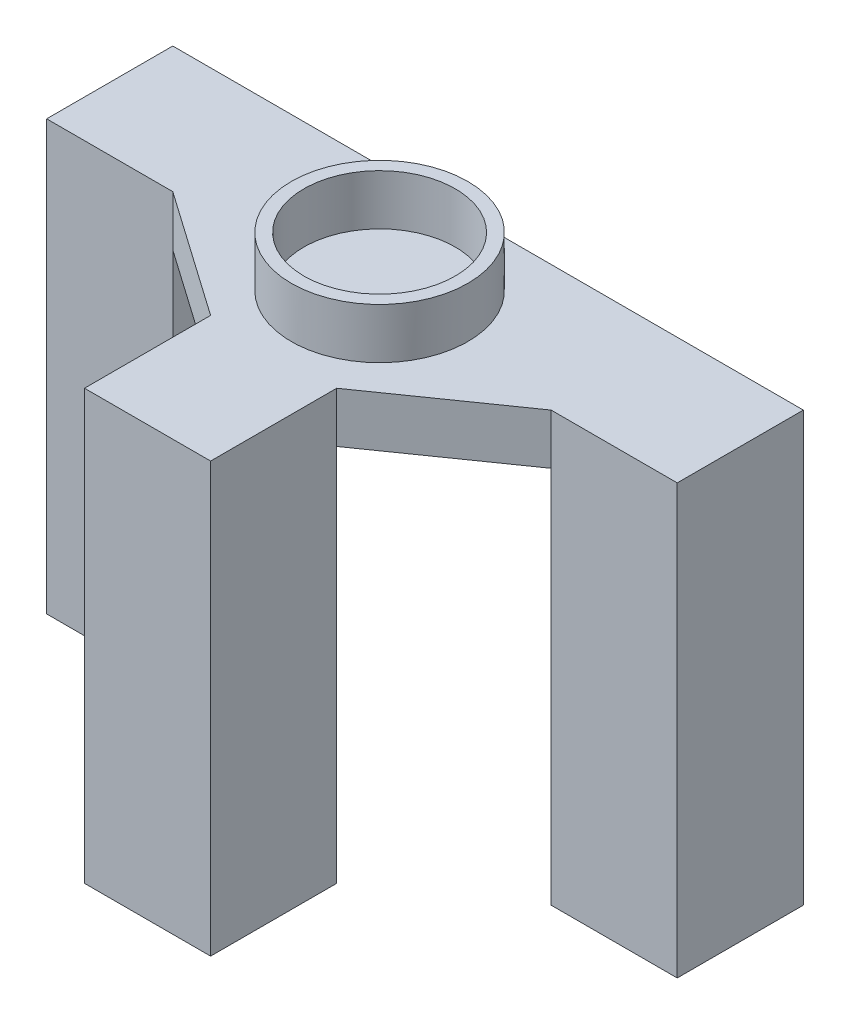
ISO-10303-21;
HEADER;
FILE_DESCRIPTION(('STEP AP214'),'2;1');
FILE_NAME('part.step','',(''),(''),'','','');
FILE_SCHEMA(('AUTOMOTIVE_DESIGN { 1 0 10303 214 1 1 1 1 }'));
ENDSEC;
DATA;
#1=APPLICATION_CONTEXT('core data for automotive mechanical design processes');
#2=APPLICATION_PROTOCOL_DEFINITION('international standard','automotive_design',2000,#1);
#3=PRODUCT_CONTEXT('',#1,'mechanical');
#4=PRODUCT('Part','Part','',(#3));
#5=PRODUCT_RELATED_PRODUCT_CATEGORY('part','',(#4));
#6=PRODUCT_DEFINITION_FORMATION('','',#4);
#7=PRODUCT_DEFINITION_CONTEXT('part definition',#1,'design');
#8=PRODUCT_DEFINITION('design','',#6,#7);
#9=PRODUCT_DEFINITION_SHAPE('','',#8);
#10=(LENGTH_UNIT() NAMED_UNIT(*) SI_UNIT(.MILLI.,.METRE.));
#11=(NAMED_UNIT(*) PLANE_ANGLE_UNIT() SI_UNIT($,.RADIAN.));
#12=(NAMED_UNIT(*) SI_UNIT($,.STERADIAN.) SOLID_ANGLE_UNIT());
#13=UNCERTAINTY_MEASURE_WITH_UNIT(LENGTH_MEASURE(1.E-05),#10,'distance_accuracy_value','');
#14=(GEOMETRIC_REPRESENTATION_CONTEXT(3) GLOBAL_UNCERTAINTY_ASSIGNED_CONTEXT((#13)) GLOBAL_UNIT_ASSIGNED_CONTEXT((#10,
#11,#12)) REPRESENTATION_CONTEXT('',''));
#15=CARTESIAN_POINT('',(0.,0.,0.));
#16=DIRECTION('',(0.,0.,1.));
#17=DIRECTION('',(1.,0.,0.));
#18=AXIS2_PLACEMENT_3D('',#15,#16,#17);
#19=CARTESIAN_POINT('',(0.,0.,0.));
#20=DIRECTION('',(0.,-1.,0.));
#21=DIRECTION('',(0.,0.,-1.));
#22=AXIS2_PLACEMENT_3D('',#19,#20,#21);
#23=PLANE('',#22);
#24=DIRECTION('',(0.81923192051904,0.,-0.573462344363329));
#25=VECTOR('',#24,1.);
#26=CARTESIAN_POINT('',(5.,0.,12.));
#27=LINE('',#26,#25);
#28=CARTESIAN_POINT('',(5.,0.,12.));
#29=VERTEX_POINT('',#28);
#30=CARTESIAN_POINT('',(15.,0.,5.));
#31=VERTEX_POINT('',#30);
#32=EDGE_CURVE('E262',#29,#31,#27,.T.);
#33=ORIENTED_EDGE('',*,*,#32,.F.);
#34=DIRECTION('',(1.,0.,0.));
#35=VECTOR('',#34,1.);
#36=CARTESIAN_POINT('',(-5.,0.,12.));
#37=LINE('',#36,#35);
#38=CARTESIAN_POINT('',(-5.,0.,12.));
#39=VERTEX_POINT('',#38);
#40=EDGE_CURVE('E163',#39,#29,#37,.T.);
#41=ORIENTED_EDGE('',*,*,#40,.F.);
#42=DIRECTION('',(0.81923192051904,0.,0.573462344363328));
#43=VECTOR('',#42,1.);
#44=CARTESIAN_POINT('',(-15.,0.,5.));
#45=LINE('',#44,#43);
#46=CARTESIAN_POINT('',(-15.,0.,5.));
#47=VERTEX_POINT('',#46);
#48=EDGE_CURVE('E224',#47,#39,#45,.T.);
#49=ORIENTED_EDGE('',*,*,#48,.F.);
#50=DIRECTION('',(0.,0.,-1.));
#51=VECTOR('',#50,1.);
#52=CARTESIAN_POINT('',(-15.,0.,-5.));
#53=LINE('',#52,#51);
#54=CARTESIAN_POINT('',(-15.,0.,-5.));
#55=VERTEX_POINT('',#54);
#56=EDGE_CURVE('E198',#47,#55,#53,.T.);
#57=ORIENTED_EDGE('',*,*,#56,.T.);
#58=DIRECTION('',(-1.,0.,0.));
#59=VECTOR('',#58,1.);
#60=CARTESIAN_POINT('',(25.,0.,-5.));
#61=LINE('',#60,#59);
#62=CARTESIAN_POINT('',(15.,0.,-5.));
#63=VERTEX_POINT('',#62);
#64=EDGE_CURVE('E62',#63,#55,#61,.T.);
#65=ORIENTED_EDGE('',*,*,#64,.F.);
#66=DIRECTION('',(0.,0.,1.));
#67=VECTOR('',#66,1.);
#68=CARTESIAN_POINT('',(15.,0.,-5.));
#69=LINE('',#68,#67);
#70=EDGE_CURVE('E55',#63,#31,#69,.T.);
#71=ORIENTED_EDGE('',*,*,#70,.T.);
#72=EDGE_LOOP('',(#33,#41,#49,#57,#65,#71));
#73=FACE_BOUND('',#72,.T.);
#74=ADVANCED_FACE('F39',(#73),#23,.T.);
#75=CARTESIAN_POINT('',(-25.,4.,5.));
#76=DIRECTION('',(0.,0.,-1.));
#77=DIRECTION('',(-1.,0.,0.));
#78=AXIS2_PLACEMENT_3D('',#75,#76,#77);
#79=PLANE('',#78);
#80=DIRECTION('',(0.,-1.,0.));
#81=VECTOR('',#80,1.);
#82=CARTESIAN_POINT('',(-25.,4.,5.));
#83=LINE('',#82,#81);
#84=CARTESIAN_POINT('',(-25.,4.,5.));
#85=VERTEX_POINT('',#84);
#86=CARTESIAN_POINT('',(-25.,-30.,5.));
#87=VERTEX_POINT('',#86);
#88=EDGE_CURVE('E258',#85,#87,#83,.T.);
#89=ORIENTED_EDGE('',*,*,#88,.T.);
#90=DIRECTION('',(1.,0.,0.));
#91=VECTOR('',#90,1.);
#92=CARTESIAN_POINT('',(-25.,-30.,5.));
#93=LINE('',#92,#91);
#94=CARTESIAN_POINT('',(-15.,-30.,5.));
#95=VERTEX_POINT('',#94);
#96=EDGE_CURVE('E205',#87,#95,#93,.T.);
#97=ORIENTED_EDGE('',*,*,#96,.T.);
#98=DIRECTION('',(0.,1.,0.));
#99=VECTOR('',#98,1.);
#100=CARTESIAN_POINT('',(-15.,-30.,5.));
#101=LINE('',#100,#99);
#102=EDGE_CURVE('E217',#95,#47,#101,.T.);
#103=ORIENTED_EDGE('',*,*,#102,.T.);
#104=DIRECTION('',(0.,-1.,0.));
#105=VECTOR('',#104,1.);
#106=CARTESIAN_POINT('',(-15.,4.,5.));
#107=LINE('',#106,#105);
#108=CARTESIAN_POINT('',(-15.,4.,5.));
#109=VERTEX_POINT('',#108);
#110=EDGE_CURVE('E48',#109,#47,#107,.T.);
#111=ORIENTED_EDGE('',*,*,#110,.F.);
#112=DIRECTION('',(1.,0.,0.));
#113=VECTOR('',#112,1.);
#114=CARTESIAN_POINT('',(-25.,4.,5.));
#115=LINE('',#114,#113);
#116=EDGE_CURVE('E227',#85,#109,#115,.T.);
#117=ORIENTED_EDGE('',*,*,#116,.F.);
#118=EDGE_LOOP('',(#89,#97,#103,#111,#117));
#119=FACE_BOUND('',#118,.T.);
#120=ADVANCED_FACE('F41',(#119),#79,.F.);
#121=CARTESIAN_POINT('',(-15.,4.,5.));
#122=DIRECTION('',(0.573462344363329,0.,-0.81923192051904));
#123=DIRECTION('',(-0.81923192051904,0.,-0.573462344363329));
#124=AXIS2_PLACEMENT_3D('',#121,#122,#123);
#125=PLANE('',#124);
#126=ORIENTED_EDGE('',*,*,#48,.T.);
#127=DIRECTION('',(0.,-1.,0.));
#128=VECTOR('',#127,1.);
#129=CARTESIAN_POINT('',(-5.,4.,12.));
#130=LINE('',#129,#128);
#131=CARTESIAN_POINT('',(-5.,4.,12.));
#132=VERTEX_POINT('',#131);
#133=EDGE_CURVE('E169',#132,#39,#130,.T.);
#134=ORIENTED_EDGE('',*,*,#133,.F.);
#135=DIRECTION('',(0.81923192051904,0.,0.573462344363328));
#136=VECTOR('',#135,1.);
#137=CARTESIAN_POINT('',(-15.,4.,5.));
#138=LINE('',#137,#136);
#139=EDGE_CURVE('E231',#109,#132,#138,.T.);
#140=ORIENTED_EDGE('',*,*,#139,.F.);
#141=ORIENTED_EDGE('',*,*,#110,.T.);
#142=EDGE_LOOP('',(#126,#134,#140,#141));
#143=FACE_BOUND('',#142,.T.);
#144=ADVANCED_FACE('F298',(#143),#125,.F.);
#145=CARTESIAN_POINT('',(-5.,4.,12.));
#146=DIRECTION('',(1.,0.,0.));
#147=DIRECTION('',(0.,0.,-1.));
#148=AXIS2_PLACEMENT_3D('',#145,#146,#147);
#149=PLANE('',#148);
#150=ORIENTED_EDGE('',*,*,#133,.T.);
#151=DIRECTION('',(0.,1.,0.));
#152=VECTOR('',#151,1.);
#153=CARTESIAN_POINT('',(-5.,-30.,12.));
#154=LINE('',#153,#152);
#155=CARTESIAN_POINT('',(-5.,-30.,12.));
#156=VERTEX_POINT('',#155);
#157=EDGE_CURVE('E145',#156,#39,#154,.T.);
#158=ORIENTED_EDGE('',*,*,#157,.F.);
#159=DIRECTION('',(0.,0.,-1.));
#160=VECTOR('',#159,1.);
#161=CARTESIAN_POINT('',(-5.,-30.,22.));
#162=LINE('',#161,#160);
#163=CARTESIAN_POINT('',(-5.,-30.,22.));
#164=VERTEX_POINT('',#163);
#165=EDGE_CURVE('E153',#164,#156,#162,.T.);
#166=ORIENTED_EDGE('',*,*,#165,.F.);
#167=DIRECTION('',(0.,-1.,0.));
#168=VECTOR('',#167,1.);
#169=CARTESIAN_POINT('',(-5.,4.,22.));
#170=LINE('',#169,#168);
#171=CARTESIAN_POINT('',(-5.,4.,22.));
#172=VERTEX_POINT('',#171);
#173=EDGE_CURVE('E290',#172,#164,#170,.T.);
#174=ORIENTED_EDGE('',*,*,#173,.F.);
#175=DIRECTION('',(0.,0.,1.));
#176=VECTOR('',#175,1.);
#177=CARTESIAN_POINT('',(-5.,4.,12.));
#178=LINE('',#177,#176);
#179=EDGE_CURVE('E234',#132,#172,#178,.T.);
#180=ORIENTED_EDGE('',*,*,#179,.F.);
#181=EDGE_LOOP('',(#150,#158,#166,#174,#180));
#182=FACE_BOUND('',#181,.T.);
#183=ADVANCED_FACE('F166',(#182),#149,.F.);
#184=CARTESIAN_POINT('',(-5.,4.,22.));
#185=DIRECTION('',(0.,0.,-1.));
#186=DIRECTION('',(-1.,0.,0.));
#187=AXIS2_PLACEMENT_3D('',#184,#185,#186);
#188=PLANE('',#187);
#189=ORIENTED_EDGE('',*,*,#173,.T.);
#190=DIRECTION('',(-1.,0.,0.));
#191=VECTOR('',#190,1.);
#192=CARTESIAN_POINT('',(-5.,-30.,22.));
#193=LINE('',#192,#191);
#194=CARTESIAN_POINT('',(5.,-30.,22.));
#195=VERTEX_POINT('',#194);
#196=EDGE_CURVE('E159',#195,#164,#193,.T.);
#197=ORIENTED_EDGE('',*,*,#196,.F.);
#198=DIRECTION('',(0.,-1.,0.));
#199=VECTOR('',#198,1.);
#200=CARTESIAN_POINT('',(5.,4.,22.));
#201=LINE('',#200,#199);
#202=CARTESIAN_POINT('',(5.,4.,22.));
#203=VERTEX_POINT('',#202);
#204=EDGE_CURVE('E287',#203,#195,#201,.T.);
#205=ORIENTED_EDGE('',*,*,#204,.F.);
#206=DIRECTION('',(1.,0.,0.));
#207=VECTOR('',#206,1.);
#208=CARTESIAN_POINT('',(-5.,4.,22.));
#209=LINE('',#208,#207);
#210=EDGE_CURVE('E237',#172,#203,#209,.T.);
#211=ORIENTED_EDGE('',*,*,#210,.F.);
#212=EDGE_LOOP('',(#189,#197,#205,#211));
#213=FACE_BOUND('',#212,.T.);
#214=ADVANCED_FACE('F405',(#213),#188,.F.);
#215=CARTESIAN_POINT('',(5.,4.,22.));
#216=DIRECTION('',(-1.,0.,0.));
#217=DIRECTION('',(0.,0.,1.));
#218=AXIS2_PLACEMENT_3D('',#215,#216,#217);
#219=PLANE('',#218);
#220=ORIENTED_EDGE('',*,*,#204,.T.);
#221=DIRECTION('',(0.,0.,1.));
#222=VECTOR('',#221,1.);
#223=CARTESIAN_POINT('',(5.,-30.,22.));
#224=LINE('',#223,#222);
#225=CARTESIAN_POINT('',(5.,-30.,12.));
#226=VERTEX_POINT('',#225);
#227=EDGE_CURVE('E152',#226,#195,#224,.T.);
#228=ORIENTED_EDGE('',*,*,#227,.F.);
#229=DIRECTION('',(0.,1.,0.));
#230=VECTOR('',#229,1.);
#231=CARTESIAN_POINT('',(5.,-30.,12.));
#232=LINE('',#231,#230);
#233=EDGE_CURVE('E147',#226,#29,#232,.T.);
#234=ORIENTED_EDGE('',*,*,#233,.T.);
#235=DIRECTION('',(0.,-1.,0.));
#236=VECTOR('',#235,1.);
#237=CARTESIAN_POINT('',(5.,4.,12.));
#238=LINE('',#237,#236);
#239=CARTESIAN_POINT('',(5.,4.,12.));
#240=VERTEX_POINT('',#239);
#241=EDGE_CURVE('E283',#240,#29,#238,.T.);
#242=ORIENTED_EDGE('',*,*,#241,.F.);
#243=DIRECTION('',(0.,0.,-1.));
#244=VECTOR('',#243,1.);
#245=CARTESIAN_POINT('',(5.,4.,22.));
#246=LINE('',#245,#244);
#247=EDGE_CURVE('E240',#203,#240,#246,.T.);
#248=ORIENTED_EDGE('',*,*,#247,.F.);
#249=EDGE_LOOP('',(#220,#228,#234,#242,#248));
#250=FACE_BOUND('',#249,.T.);
#251=ADVANCED_FACE('F401',(#250),#219,.F.);
#252=CARTESIAN_POINT('',(5.,4.,12.));
#253=DIRECTION('',(-0.573462344363329,0.,-0.81923192051904));
#254=DIRECTION('',(-0.81923192051904,0.,0.573462344363329));
#255=AXIS2_PLACEMENT_3D('',#252,#253,#254);
#256=PLANE('',#255);
#257=ORIENTED_EDGE('',*,*,#32,.T.);
#258=DIRECTION('',(0.,-1.,0.));
#259=VECTOR('',#258,1.);
#260=CARTESIAN_POINT('',(15.,4.,5.));
#261=LINE('',#260,#259);
#262=CARTESIAN_POINT('',(15.,4.,5.));
#263=VERTEX_POINT('',#262);
#264=EDGE_CURVE('E279',#263,#31,#261,.T.);
#265=ORIENTED_EDGE('',*,*,#264,.F.);
#266=DIRECTION('',(0.81923192051904,0.,-0.573462344363329));
#267=VECTOR('',#266,1.);
#268=CARTESIAN_POINT('',(5.,4.,12.));
#269=LINE('',#268,#267);
#270=EDGE_CURVE('E243',#240,#263,#269,.T.);
#271=ORIENTED_EDGE('',*,*,#270,.F.);
#272=ORIENTED_EDGE('',*,*,#241,.T.);
#273=EDGE_LOOP('',(#257,#265,#271,#272));
#274=FACE_BOUND('',#273,.T.);
#275=ADVANCED_FACE('F397',(#274),#256,.F.);
#276=CARTESIAN_POINT('',(15.,4.,5.));
#277=DIRECTION('',(0.,0.,-1.));
#278=DIRECTION('',(-1.,0.,0.));
#279=AXIS2_PLACEMENT_3D('',#276,#277,#278);
#280=PLANE('',#279);
#281=ORIENTED_EDGE('',*,*,#264,.T.);
#282=DIRECTION('',(0.,1.,0.));
#283=VECTOR('',#282,1.);
#284=CARTESIAN_POINT('',(15.,-30.,5.));
#285=LINE('',#284,#283);
#286=CARTESIAN_POINT('',(15.,-30.,5.));
#287=VERTEX_POINT('',#286);
#288=EDGE_CURVE('E193',#287,#31,#285,.T.);
#289=ORIENTED_EDGE('',*,*,#288,.F.);
#290=DIRECTION('',(1.,0.,0.));
#291=VECTOR('',#290,1.);
#292=CARTESIAN_POINT('',(15.,-30.,5.));
#293=LINE('',#292,#291);
#294=CARTESIAN_POINT('',(25.,-30.,5.));
#295=VERTEX_POINT('',#294);
#296=EDGE_CURVE('E182',#287,#295,#293,.T.);
#297=ORIENTED_EDGE('',*,*,#296,.T.);
#298=DIRECTION('',(0.,-1.,0.));
#299=VECTOR('',#298,1.);
#300=CARTESIAN_POINT('',(25.,4.,5.));
#301=LINE('',#300,#299);
#302=CARTESIAN_POINT('',(25.,4.,5.));
#303=VERTEX_POINT('',#302);
#304=EDGE_CURVE('E276',#303,#295,#301,.T.);
#305=ORIENTED_EDGE('',*,*,#304,.F.);
#306=DIRECTION('',(1.,0.,0.));
#307=VECTOR('',#306,1.);
#308=CARTESIAN_POINT('',(15.,4.,5.));
#309=LINE('',#308,#307);
#310=EDGE_CURVE('E246',#263,#303,#309,.T.);
#311=ORIENTED_EDGE('',*,*,#310,.F.);
#312=EDGE_LOOP('',(#281,#289,#297,#305,#311));
#313=FACE_BOUND('',#312,.T.);
#314=ADVANCED_FACE('F393',(#313),#280,.F.);
#315=CARTESIAN_POINT('',(25.,4.,5.));
#316=DIRECTION('',(-1.,0.,0.));
#317=DIRECTION('',(0.,0.,1.));
#318=AXIS2_PLACEMENT_3D('',#315,#316,#317);
#319=PLANE('',#318);
#320=ORIENTED_EDGE('',*,*,#304,.T.);
#321=DIRECTION('',(0.,0.,-1.));
#322=VECTOR('',#321,1.);
#323=CARTESIAN_POINT('',(25.,-30.,-5.));
#324=LINE('',#323,#322);
#325=CARTESIAN_POINT('',(25.,-30.,-5.));
#326=VERTEX_POINT('',#325);
#327=EDGE_CURVE('E186',#295,#326,#324,.T.);
#328=ORIENTED_EDGE('',*,*,#327,.T.);
#329=DIRECTION('',(0.,-1.,0.));
#330=VECTOR('',#329,1.);
#331=CARTESIAN_POINT('',(25.,4.,-5.));
#332=LINE('',#331,#330);
#333=CARTESIAN_POINT('',(25.,4.,-5.));
#334=VERTEX_POINT('',#333);
#335=EDGE_CURVE('E273',#334,#326,#332,.T.);
#336=ORIENTED_EDGE('',*,*,#335,.F.);
#337=DIRECTION('',(0.,0.,-1.));
#338=VECTOR('',#337,1.);
#339=CARTESIAN_POINT('',(25.,4.,5.));
#340=LINE('',#339,#338);
#341=EDGE_CURVE('E249',#303,#334,#340,.T.);
#342=ORIENTED_EDGE('',*,*,#341,.F.);
#343=EDGE_LOOP('',(#320,#328,#336,#342));
#344=FACE_BOUND('',#343,.T.);
#345=ADVANCED_FACE('F390',(#344),#319,.F.);
#346=CARTESIAN_POINT('',(25.,4.,-5.));
#347=DIRECTION('',(0.,0.,1.));
#348=DIRECTION('',(1.,0.,0.));
#349=AXIS2_PLACEMENT_3D('',#346,#347,#348);
#350=PLANE('',#349);
#351=ORIENTED_EDGE('',*,*,#335,.T.);
#352=DIRECTION('',(-1.,0.,0.));
#353=VECTOR('',#352,1.);
#354=CARTESIAN_POINT('',(15.,-30.,-5.));
#355=LINE('',#354,#353);
#356=CARTESIAN_POINT('',(15.,-30.,-5.));
#357=VERTEX_POINT('',#356);
#358=EDGE_CURVE('E190',#326,#357,#355,.T.);
#359=ORIENTED_EDGE('',*,*,#358,.T.);
#360=DIRECTION('',(0.,1.,0.));
#361=VECTOR('',#360,1.);
#362=CARTESIAN_POINT('',(15.,-30.,-5.));
#363=LINE('',#362,#361);
#364=EDGE_CURVE('E195',#357,#63,#363,.T.);
#365=ORIENTED_EDGE('',*,*,#364,.T.);
#366=ORIENTED_EDGE('',*,*,#64,.T.);
#367=DIRECTION('',(0.,1.,0.));
#368=VECTOR('',#367,1.);
#369=CARTESIAN_POINT('',(-15.,-30.,-5.));
#370=LINE('',#369,#368);
#371=CARTESIAN_POINT('',(-15.,-30.,-5.));
#372=VERTEX_POINT('',#371);
#373=EDGE_CURVE('E221',#372,#55,#370,.T.);
#374=ORIENTED_EDGE('',*,*,#373,.F.);
#375=DIRECTION('',(-1.,0.,0.));
#376=VECTOR('',#375,1.);
#377=CARTESIAN_POINT('',(-25.,-30.,-5.));
#378=LINE('',#377,#376);
#379=CARTESIAN_POINT('',(-25.,-30.,-5.));
#380=VERTEX_POINT('',#379);
#381=EDGE_CURVE('E213',#372,#380,#378,.T.);
#382=ORIENTED_EDGE('',*,*,#381,.T.);
#383=DIRECTION('',(0.,-1.,0.));
#384=VECTOR('',#383,1.);
#385=CARTESIAN_POINT('',(-25.,4.,-5.));
#386=LINE('',#385,#384);
#387=CARTESIAN_POINT('',(-25.,4.,-5.));
#388=VERTEX_POINT('',#387);
#389=EDGE_CURVE('E270',#388,#380,#386,.T.);
#390=ORIENTED_EDGE('',*,*,#389,.F.);
#391=DIRECTION('',(-1.,0.,0.));
#392=VECTOR('',#391,1.);
#393=CARTESIAN_POINT('',(25.,4.,-5.));
#394=LINE('',#393,#392);
#395=EDGE_CURVE('E252',#334,#388,#394,.T.);
#396=ORIENTED_EDGE('',*,*,#395,.F.);
#397=EDGE_LOOP('',(#351,#359,#365,#366,#374,#382,#390,#396));
#398=FACE_BOUND('',#397,.T.);
#399=ADVANCED_FACE('F386',(#398),#350,.F.);
#400=CARTESIAN_POINT('',(-25.,4.,-5.));
#401=DIRECTION('',(1.,0.,0.));
#402=DIRECTION('',(0.,0.,-1.));
#403=AXIS2_PLACEMENT_3D('',#400,#401,#402);
#404=PLANE('',#403);
#405=ORIENTED_EDGE('',*,*,#389,.T.);
#406=DIRECTION('',(0.,0.,1.));
#407=VECTOR('',#406,1.);
#408=CARTESIAN_POINT('',(-25.,-30.,-5.));
#409=LINE('',#408,#407);
#410=EDGE_CURVE('E201',#380,#87,#409,.T.);
#411=ORIENTED_EDGE('',*,*,#410,.T.);
#412=ORIENTED_EDGE('',*,*,#88,.F.);
#413=DIRECTION('',(0.,0.,1.));
#414=VECTOR('',#413,1.);
#415=CARTESIAN_POINT('',(-25.,4.,-5.));
#416=LINE('',#415,#414);
#417=EDGE_CURVE('E255',#388,#85,#416,.T.);
#418=ORIENTED_EDGE('',*,*,#417,.F.);
#419=EDGE_LOOP('',(#405,#411,#412,#418));
#420=FACE_BOUND('',#419,.T.);
#421=ADVANCED_FACE('F383',(#420),#404,.F.);
#422=CARTESIAN_POINT('',(0.,4.,0.));
#423=DIRECTION('',(0.,-1.,0.));
#424=DIRECTION('',(0.,0.,-1.));
#425=AXIS2_PLACEMENT_3D('',#422,#423,#424);
#426=PLANE('',#425);
#427=CARTESIAN_POINT('',(0.,4.,3.6));
#428=DIRECTION('',(0.,-1.,0.));
#429=DIRECTION('',(0.,0.,-1.));
#430=AXIS2_PLACEMENT_3D('',#427,#428,#429);
#431=CIRCLE('',#430,7.);
#432=CARTESIAN_POINT('',(0.,4.,-3.4));
#433=VERTEX_POINT('',#432);
#434=EDGE_CURVE('E11',#433,#433,#431,.F.);
#435=ORIENTED_EDGE('',*,*,#434,.F.);
#436=EDGE_LOOP('',(#435));
#437=FACE_BOUND('',#436,.T.);
#438=ORIENTED_EDGE('',*,*,#116,.T.);
#439=ORIENTED_EDGE('',*,*,#139,.T.);
#440=ORIENTED_EDGE('',*,*,#179,.T.);
#441=ORIENTED_EDGE('',*,*,#210,.T.);
#442=ORIENTED_EDGE('',*,*,#247,.T.);
#443=ORIENTED_EDGE('',*,*,#270,.T.);
#444=ORIENTED_EDGE('',*,*,#310,.T.);
#445=ORIENTED_EDGE('',*,*,#341,.T.);
#446=ORIENTED_EDGE('',*,*,#395,.T.);
#447=ORIENTED_EDGE('',*,*,#417,.T.);
#448=EDGE_LOOP('',(#438,#439,#440,#441,#442,#443,#444,#445,#446,#447));
#449=FACE_BOUND('',#448,.T.);
#450=ADVANCED_FACE('F381',(#437,#449),#426,.F.);
#451=CARTESIAN_POINT('',(-15.,-30.,-5.));
#452=DIRECTION('',(1.,0.,0.));
#453=DIRECTION('',(0.,0.,-1.));
#454=AXIS2_PLACEMENT_3D('',#451,#452,#453);
#455=PLANE('',#454);
#456=ORIENTED_EDGE('',*,*,#56,.F.);
#457=ORIENTED_EDGE('',*,*,#102,.F.);
#458=DIRECTION('',(0.,0.,-1.));
#459=VECTOR('',#458,1.);
#460=CARTESIAN_POINT('',(-15.,-30.,-5.));
#461=LINE('',#460,#459);
#462=EDGE_CURVE('E209',#95,#372,#461,.T.);
#463=ORIENTED_EDGE('',*,*,#462,.T.);
#464=ORIENTED_EDGE('',*,*,#373,.T.);
#465=EDGE_LOOP('',(#456,#457,#463,#464));
#466=FACE_BOUND('',#465,.T.);
#467=ADVANCED_FACE('F306',(#466),#455,.T.);
#468=CARTESIAN_POINT('',(0.,-30.,0.));
#469=DIRECTION('',(0.,1.,0.));
#470=DIRECTION('',(0.,0.,1.));
#471=AXIS2_PLACEMENT_3D('',#468,#469,#470);
#472=PLANE('',#471);
#473=CARTESIAN_POINT('',(-20.,-30.,0.));
#474=DIRECTION('',(0.,-1.,0.));
#475=DIRECTION('',(0.,0.,-1.));
#476=AXIS2_PLACEMENT_3D('',#473,#474,#475);
#477=CIRCLE('',#476,4.);
#478=CARTESIAN_POINT('',(-20.,-30.,-4.));
#479=VERTEX_POINT('',#478);
#480=EDGE_CURVE('E328',#479,#479,#477,.T.);
#481=ORIENTED_EDGE('',*,*,#480,.F.);
#482=EDGE_LOOP('',(#481));
#483=FACE_BOUND('',#482,.T.);
#484=ORIENTED_EDGE('',*,*,#410,.F.);
#485=ORIENTED_EDGE('',*,*,#381,.F.);
#486=ORIENTED_EDGE('',*,*,#462,.F.);
#487=ORIENTED_EDGE('',*,*,#96,.F.);
#488=EDGE_LOOP('',(#484,#485,#486,#487));
#489=FACE_BOUND('',#488,.T.);
#490=ADVANCED_FACE('F462',(#483,#489),#472,.F.);
#491=CARTESIAN_POINT('',(15.,-30.,-5.));
#492=DIRECTION('',(-1.,0.,0.));
#493=DIRECTION('',(0.,0.,1.));
#494=AXIS2_PLACEMENT_3D('',#491,#492,#493);
#495=PLANE('',#494);
#496=ORIENTED_EDGE('',*,*,#70,.F.);
#497=ORIENTED_EDGE('',*,*,#364,.F.);
#498=DIRECTION('',(0.,0.,1.));
#499=VECTOR('',#498,1.);
#500=CARTESIAN_POINT('',(15.,-30.,-5.));
#501=LINE('',#500,#499);
#502=EDGE_CURVE('E174',#357,#287,#501,.T.);
#503=ORIENTED_EDGE('',*,*,#502,.T.);
#504=ORIENTED_EDGE('',*,*,#288,.T.);
#505=EDGE_LOOP('',(#496,#497,#503,#504));
#506=FACE_BOUND('',#505,.T.);
#507=ADVANCED_FACE('F469',(#506),#495,.T.);
#508=CARTESIAN_POINT('',(0.,-30.,0.));
#509=DIRECTION('',(0.,1.,0.));
#510=DIRECTION('',(0.,0.,1.));
#511=AXIS2_PLACEMENT_3D('',#508,#509,#510);
#512=PLANE('',#511);
#513=CARTESIAN_POINT('',(20.,-30.,0.));
#514=DIRECTION('',(0.,-1.,0.));
#515=DIRECTION('',(0.,0.,-1.));
#516=AXIS2_PLACEMENT_3D('',#513,#514,#515);
#517=CIRCLE('',#516,4.);
#518=CARTESIAN_POINT('',(20.,-30.,-4.));
#519=VERTEX_POINT('',#518);
#520=EDGE_CURVE('E336',#519,#519,#517,.T.);
#521=ORIENTED_EDGE('',*,*,#520,.F.);
#522=EDGE_LOOP('',(#521));
#523=FACE_BOUND('',#522,.T.);
#524=ORIENTED_EDGE('',*,*,#502,.F.);
#525=ORIENTED_EDGE('',*,*,#358,.F.);
#526=ORIENTED_EDGE('',*,*,#327,.F.);
#527=ORIENTED_EDGE('',*,*,#296,.F.);
#528=EDGE_LOOP('',(#524,#525,#526,#527));
#529=FACE_BOUND('',#528,.T.);
#530=ADVANCED_FACE('F371',(#523,#529),#512,.F.);
#531=CARTESIAN_POINT('',(-5.,-30.,12.));
#532=DIRECTION('',(0.,0.,1.));
#533=DIRECTION('',(1.,0.,0.));
#534=AXIS2_PLACEMENT_3D('',#531,#532,#533);
#535=PLANE('',#534);
#536=ORIENTED_EDGE('',*,*,#40,.T.);
#537=ORIENTED_EDGE('',*,*,#233,.F.);
#538=DIRECTION('',(1.,0.,0.));
#539=VECTOR('',#538,1.);
#540=CARTESIAN_POINT('',(-5.,-30.,12.));
#541=LINE('',#540,#539);
#542=EDGE_CURVE('E140',#156,#226,#541,.T.);
#543=ORIENTED_EDGE('',*,*,#542,.F.);
#544=ORIENTED_EDGE('',*,*,#157,.T.);
#545=EDGE_LOOP('',(#536,#537,#543,#544));
#546=FACE_BOUND('',#545,.T.);
#547=ADVANCED_FACE('F143',(#546),#535,.F.);
#548=CARTESIAN_POINT('',(0.,-30.,0.));
#549=DIRECTION('',(0.,-1.,0.));
#550=DIRECTION('',(0.,0.,-1.));
#551=AXIS2_PLACEMENT_3D('',#548,#549,#550);
#552=PLANE('',#551);
#553=CARTESIAN_POINT('',(0.,-30.,17.));
#554=DIRECTION('',(0.,-1.,0.));
#555=DIRECTION('',(0.,0.,-1.));
#556=AXIS2_PLACEMENT_3D('',#553,#554,#555);
#557=CIRCLE('',#556,4.);
#558=CARTESIAN_POINT('',(0.,-30.,13.));
#559=VERTEX_POINT('',#558);
#560=EDGE_CURVE('E344',#559,#559,#557,.T.);
#561=ORIENTED_EDGE('',*,*,#560,.F.);
#562=EDGE_LOOP('',(#561));
#563=FACE_BOUND('',#562,.T.);
#564=ORIENTED_EDGE('',*,*,#165,.T.);
#565=ORIENTED_EDGE('',*,*,#542,.T.);
#566=ORIENTED_EDGE('',*,*,#227,.T.);
#567=ORIENTED_EDGE('',*,*,#196,.T.);
#568=EDGE_LOOP('',(#564,#565,#566,#567));
#569=FACE_BOUND('',#568,.T.);
#570=ADVANCED_FACE('F157',(#563,#569),#552,.T.);
#571=CARTESIAN_POINT('',(0.,8.,3.6));
#572=DIRECTION('',(0.,1.,0.));
#573=DIRECTION('',(0.,0.,1.));
#574=AXIS2_PLACEMENT_3D('',#571,#572,#573);
#575=PLANE('',#574);
#576=CARTESIAN_POINT('',(0.,8.,3.6));
#577=DIRECTION('',(0.,1.,0.));
#578=DIRECTION('',(0.,0.,1.));
#579=AXIS2_PLACEMENT_3D('',#576,#577,#578);
#580=CIRCLE('',#579,7.);
#581=CARTESIAN_POINT('',(0.,8.,10.6));
#582=VERTEX_POINT('',#581);
#583=EDGE_CURVE('E310',#582,#582,#580,.T.);
#584=ORIENTED_EDGE('',*,*,#583,.T.);
#585=EDGE_LOOP('',(#584));
#586=FACE_BOUND('',#585,.T.);
#587=CARTESIAN_POINT('',(0.,8.,3.6));
#588=DIRECTION('',(0.,1.,0.));
#589=DIRECTION('',(0.,0.,1.));
#590=AXIS2_PLACEMENT_3D('',#587,#588,#589);
#591=CIRCLE('',#590,6.);
#592=CARTESIAN_POINT('',(0.,8.,9.6));
#593=VERTEX_POINT('',#592);
#594=EDGE_CURVE('E313',#593,#593,#591,.T.);
#595=ORIENTED_EDGE('',*,*,#594,.F.);
#596=EDGE_LOOP('',(#595));
#597=FACE_BOUND('',#596,.T.);
#598=ADVANCED_FACE('F362',(#586,#597),#575,.T.);
#599=CARTESIAN_POINT('',(0.,8.,3.6));
#600=DIRECTION('',(0.,-1.,0.));
#601=DIRECTION('',(0.,0.,-1.));
#602=AXIS2_PLACEMENT_3D('',#599,#600,#601);
#603=CYLINDRICAL_SURFACE('',#602,7.);
#604=ORIENTED_EDGE('',*,*,#583,.F.);
#605=EDGE_LOOP('',(#604));
#606=FACE_BOUND('',#605,.T.);
#607=ORIENTED_EDGE('',*,*,#434,.T.);
#608=EDGE_LOOP('',(#607));
#609=FACE_BOUND('',#608,.T.);
#610=ADVANCED_FACE('F368',(#606,#609),#603,.T.);
#611=CARTESIAN_POINT('',(0.,8.,3.6));
#612=DIRECTION('',(0.,-1.,0.));
#613=DIRECTION('',(0.,0.,-1.));
#614=AXIS2_PLACEMENT_3D('',#611,#612,#613);
#615=CYLINDRICAL_SURFACE('',#614,6.);
#616=ORIENTED_EDGE('',*,*,#594,.T.);
#617=EDGE_LOOP('',(#616));
#618=FACE_BOUND('',#617,.T.);
#619=CARTESIAN_POINT('',(0.,4.,3.6));
#620=DIRECTION('',(0.,1.,0.));
#621=DIRECTION('',(0.,0.,1.));
#622=AXIS2_PLACEMENT_3D('',#619,#620,#621);
#623=CIRCLE('',#622,6.);
#624=CARTESIAN_POINT('',(0.,4.,9.6));
#625=VERTEX_POINT('',#624);
#626=EDGE_CURVE('E320',#625,#625,#623,.T.);
#627=ORIENTED_EDGE('',*,*,#626,.F.);
#628=EDGE_LOOP('',(#627));
#629=FACE_BOUND('',#628,.T.);
#630=ADVANCED_FACE('F504',(#618,#629),#615,.F.);
#631=ORIENTED_EDGE('',*,*,#626,.T.);
#632=EDGE_LOOP('',(#631));
#633=FACE_BOUND('',#632,.T.);
#634=ADVANCED_FACE('F357',(#633),#426,.F.);
#635=CARTESIAN_POINT('',(0.,0.,17.));
#636=DIRECTION('',(0.,-1.,0.));
#637=DIRECTION('',(0.,0.,-1.));
#638=AXIS2_PLACEMENT_3D('',#635,#636,#637);
#639=CYLINDRICAL_SURFACE('',#638,4.);
#640=CARTESIAN_POINT('',(0.,0.,17.));
#641=DIRECTION('',(0.,-1.,0.));
#642=DIRECTION('',(0.,0.,-1.));
#643=AXIS2_PLACEMENT_3D('',#640,#641,#642);
#644=CIRCLE('',#643,4.);
#645=CARTESIAN_POINT('',(0.,0.,13.));
#646=VERTEX_POINT('',#645);
#647=EDGE_CURVE('E324',#646,#646,#644,.T.);
#648=ORIENTED_EDGE('',*,*,#647,.F.);
#649=EDGE_LOOP('',(#648));
#650=FACE_BOUND('',#649,.T.);
#651=ORIENTED_EDGE('',*,*,#560,.T.);
#652=EDGE_LOOP('',(#651));
#653=FACE_BOUND('',#652,.T.);
#654=ADVANCED_FACE('F354',(#650,#653),#639,.F.);
#655=CARTESIAN_POINT('',(0.,0.,17.));
#656=DIRECTION('',(0.,-1.,0.));
#657=DIRECTION('',(0.,0.,-1.));
#658=AXIS2_PLACEMENT_3D('',#655,#656,#657);
#659=PLANE('',#658);
#660=ORIENTED_EDGE('',*,*,#647,.T.);
#661=EDGE_LOOP('',(#660));
#662=FACE_BOUND('',#661,.T.);
#663=ADVANCED_FACE('F352',(#662),#659,.T.);
#664=CARTESIAN_POINT('',(20.,0.,0.));
#665=DIRECTION('',(0.,-1.,0.));
#666=DIRECTION('',(0.,0.,-1.));
#667=AXIS2_PLACEMENT_3D('',#664,#665,#666);
#668=CYLINDRICAL_SURFACE('',#667,4.);
#669=CARTESIAN_POINT('',(20.,0.,0.));
#670=DIRECTION('',(0.,-1.,0.));
#671=DIRECTION('',(0.,0.,-1.));
#672=AXIS2_PLACEMENT_3D('',#669,#670,#671);
#673=CIRCLE('',#672,4.);
#674=CARTESIAN_POINT('',(20.,0.,-4.));
#675=VERTEX_POINT('',#674);
#676=EDGE_CURVE('E340',#675,#675,#673,.T.);
#677=ORIENTED_EDGE('',*,*,#676,.F.);
#678=EDGE_LOOP('',(#677));
#679=FACE_BOUND('',#678,.T.);
#680=ORIENTED_EDGE('',*,*,#520,.T.);
#681=EDGE_LOOP('',(#680));
#682=FACE_BOUND('',#681,.T.);
#683=ADVANCED_FACE('F535',(#679,#682),#668,.F.);
#684=CARTESIAN_POINT('',(20.,0.,0.));
#685=DIRECTION('',(0.,-1.,0.));
#686=DIRECTION('',(0.,0.,-1.));
#687=AXIS2_PLACEMENT_3D('',#684,#685,#686);
#688=PLANE('',#687);
#689=ORIENTED_EDGE('',*,*,#676,.T.);
#690=EDGE_LOOP('',(#689));
#691=FACE_BOUND('',#690,.T.);
#692=ADVANCED_FACE('F543',(#691),#688,.T.);
#693=CARTESIAN_POINT('',(-20.,0.,0.));
#694=DIRECTION('',(0.,-1.,0.));
#695=DIRECTION('',(0.,0.,-1.));
#696=AXIS2_PLACEMENT_3D('',#693,#694,#695);
#697=CYLINDRICAL_SURFACE('',#696,4.);
#698=CARTESIAN_POINT('',(-20.,0.,0.));
#699=DIRECTION('',(0.,-1.,0.));
#700=DIRECTION('',(0.,0.,-1.));
#701=AXIS2_PLACEMENT_3D('',#698,#699,#700);
#702=CIRCLE('',#701,4.);
#703=CARTESIAN_POINT('',(-20.,0.,-4.));
#704=VERTEX_POINT('',#703);
#705=EDGE_CURVE('E332',#704,#704,#702,.T.);
#706=ORIENTED_EDGE('',*,*,#705,.F.);
#707=EDGE_LOOP('',(#706));
#708=FACE_BOUND('',#707,.T.);
#709=ORIENTED_EDGE('',*,*,#480,.T.);
#710=EDGE_LOOP('',(#709));
#711=FACE_BOUND('',#710,.T.);
#712=ADVANCED_FACE('F552',(#708,#711),#697,.F.);
#713=CARTESIAN_POINT('',(-20.,0.,0.));
#714=DIRECTION('',(0.,-1.,0.));
#715=DIRECTION('',(0.,0.,-1.));
#716=AXIS2_PLACEMENT_3D('',#713,#714,#715);
#717=PLANE('',#716);
#718=ORIENTED_EDGE('',*,*,#705,.T.);
#719=EDGE_LOOP('',(#718));
#720=FACE_BOUND('',#719,.T.);
#721=ADVANCED_FACE('F561',(#720),#717,.T.);
#722=CLOSED_SHELL('',(#74,#120,#144,#183,#214,#251,#275,#314,#345,#399,#421,#450,#467,#490,#507,
#530,#547,#570,#598,#610,#630,#634,#654,#663,#683,#692,#712,#721));
#723=MANIFOLD_SOLID_BREP('B2',#722);
#724=ADVANCED_BREP_SHAPE_REPRESENTATION('',(#18,#723),#14);
#725=SHAPE_DEFINITION_REPRESENTATION(#9,#724);
ENDSEC;
END-ISO-10303-21;
